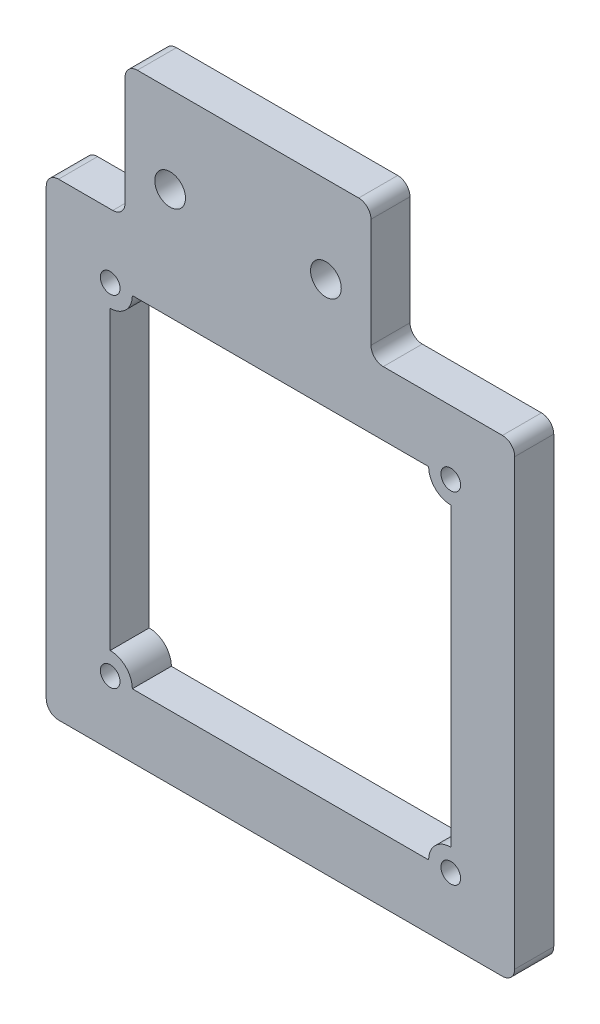
ISO-10303-21;
HEADER;
FILE_DESCRIPTION(('STEP AP214'),'2;1');
FILE_NAME('part.step','',(''),(''),'','','');
FILE_SCHEMA(('AUTOMOTIVE_DESIGN { 1 0 10303 214 1 1 1 1 }'));
ENDSEC;
DATA;
#1=APPLICATION_CONTEXT('core data for automotive mechanical design processes');
#2=APPLICATION_PROTOCOL_DEFINITION('international standard','automotive_design',2000,#1);
#3=PRODUCT_CONTEXT('',#1,'mechanical');
#4=PRODUCT('Part','Part','',(#3));
#5=PRODUCT_RELATED_PRODUCT_CATEGORY('part','',(#4));
#6=PRODUCT_DEFINITION_FORMATION('','',#4);
#7=PRODUCT_DEFINITION_CONTEXT('part definition',#1,'design');
#8=PRODUCT_DEFINITION('design','',#6,#7);
#9=PRODUCT_DEFINITION_SHAPE('','',#8);
#10=(LENGTH_UNIT() NAMED_UNIT(*) SI_UNIT(.MILLI.,.METRE.));
#11=(NAMED_UNIT(*) PLANE_ANGLE_UNIT() SI_UNIT($,.RADIAN.));
#12=(NAMED_UNIT(*) SI_UNIT($,.STERADIAN.) SOLID_ANGLE_UNIT());
#13=UNCERTAINTY_MEASURE_WITH_UNIT(LENGTH_MEASURE(1.E-05),#10,'distance_accuracy_value','');
#14=(GEOMETRIC_REPRESENTATION_CONTEXT(3) GLOBAL_UNCERTAINTY_ASSIGNED_CONTEXT((#13)) GLOBAL_UNIT_ASSIGNED_CONTEXT((#10,
#11,#12)) REPRESENTATION_CONTEXT('',''));
#15=CARTESIAN_POINT('',(0.,0.,0.));
#16=DIRECTION('',(0.,0.,1.));
#17=DIRECTION('',(1.,0.,0.));
#18=AXIS2_PLACEMENT_3D('',#15,#16,#17);
#19=CARTESIAN_POINT('',(0.,0.,3.175));
#20=DIRECTION('',(0.,0.,1.));
#21=DIRECTION('',(1.,0.,0.));
#22=AXIS2_PLACEMENT_3D('',#19,#20,#21);
#23=PLANE('',#22);
#24=CARTESIAN_POINT('',(-1.20910547078258,-5.19999999999999,3.175));
#25=DIRECTION('',(0.,0.,1.));
#26=DIRECTION('',(1.,0.,0.));
#27=AXIS2_PLACEMENT_3D('',#24,#25,#26);
#28=CIRCLE('',#27,0.8);
#29=CARTESIAN_POINT('',(-0.409105470782583,-5.19999999999999,3.175));
#30=VERTEX_POINT('',#29);
#31=EDGE_CURVE('E907',#30,#30,#28,.T.);
#32=ORIENTED_EDGE('',*,*,#31,.F.);
#33=EDGE_LOOP('',(#32));
#34=FACE_BOUND('',#33,.T.);
#35=CARTESIAN_POINT('',(3.66495523115076,3.81159322250824,3.175));
#36=DIRECTION('',(0.,0.,1.));
#37=DIRECTION('',(1.,0.,0.));
#38=AXIS2_PLACEMENT_3D('',#35,#36,#37);
#39=CIRCLE('',#38,1.25);
#40=CARTESIAN_POINT('',(4.91495523115076,3.81159322250824,3.175));
#41=VERTEX_POINT('',#40);
#42=EDGE_CURVE('E592',#41,#41,#39,.T.);
#43=ORIENTED_EDGE('',*,*,#42,.F.);
#44=EDGE_LOOP('',(#43));
#45=FACE_BOUND('',#44,.T.);
#46=CARTESIAN_POINT('',(-1.20910547078258,-32.9,3.175));
#47=DIRECTION('',(0.,0.,1.));
#48=DIRECTION('',(1.,0.,0.));
#49=AXIS2_PLACEMENT_3D('',#46,#47,#48);
#50=CIRCLE('',#49,0.800000000000001);
#51=CARTESIAN_POINT('',(-0.409105470782583,-32.9,3.175));
#52=VERTEX_POINT('',#51);
#53=EDGE_CURVE('E604',#52,#52,#50,.T.);
#54=ORIENTED_EDGE('',*,*,#53,.F.);
#55=EDGE_LOOP('',(#54));
#56=FACE_BOUND('',#55,.T.);
#57=DIRECTION('',(0.,-1.,0.));
#58=VECTOR('',#57,1.);
#59=CARTESIAN_POINT('',(20.,10.8755385296888,3.175));
#60=LINE('',#59,#58);
#61=CARTESIAN_POINT('',(20.,9.87553852968881,3.175));
#62=VERTEX_POINT('',#61);
#63=CARTESIAN_POINT('',(20.,1.,3.175));
#64=VERTEX_POINT('',#63);
#65=EDGE_CURVE('E630',#62,#64,#60,.T.);
#66=ORIENTED_EDGE('',*,*,#65,.F.);
#67=CARTESIAN_POINT('',(19.,9.87553852968881,3.175));
#68=DIRECTION('',(0.,0.,1.));
#69=DIRECTION('',(1.,0.,0.));
#70=AXIS2_PLACEMENT_3D('',#67,#68,#69);
#71=CIRCLE('',#70,1.);
#72=CARTESIAN_POINT('',(19.,10.8755385296888,3.175));
#73=VERTEX_POINT('',#72);
#74=EDGE_CURVE('E690',#62,#73,#71,.T.);
#75=ORIENTED_EDGE('',*,*,#74,.T.);
#76=DIRECTION('',(-1.,0.,0.));
#77=VECTOR('',#76,1.);
#78=CARTESIAN_POINT('',(20.,10.8755385296888,3.175));
#79=LINE('',#78,#77);
#80=CARTESIAN_POINT('',(1.,10.8755385296888,3.175));
#81=VERTEX_POINT('',#80);
#82=EDGE_CURVE('E610',#73,#81,#79,.T.);
#83=ORIENTED_EDGE('',*,*,#82,.T.);
#84=CARTESIAN_POINT('',(1.,9.87553852968881,3.175));
#85=DIRECTION('',(0.,0.,1.));
#86=DIRECTION('',(1.,0.,0.));
#87=AXIS2_PLACEMENT_3D('',#84,#85,#86);
#88=CIRCLE('',#87,1.);
#89=CARTESIAN_POINT('',(0.,9.87553852968881,3.175));
#90=VERTEX_POINT('',#89);
#91=EDGE_CURVE('E688',#81,#90,#88,.T.);
#92=ORIENTED_EDGE('',*,*,#91,.T.);
#93=DIRECTION('',(0.,-1.,0.));
#94=VECTOR('',#93,1.);
#95=CARTESIAN_POINT('',(0.,10.8755385296888,3.175));
#96=LINE('',#95,#94);
#97=CARTESIAN_POINT('',(0.,1.,3.175));
#98=VERTEX_POINT('',#97);
#99=EDGE_CURVE('E613',#90,#98,#96,.T.);
#100=ORIENTED_EDGE('',*,*,#99,.T.);
#101=CARTESIAN_POINT('',(-1.,1.,3.175));
#102=DIRECTION('',(0.,0.,1.));
#103=DIRECTION('',(1.,0.,0.));
#104=AXIS2_PLACEMENT_3D('',#101,#102,#103);
#105=CIRCLE('',#104,1.);
#106=CARTESIAN_POINT('',(-1.,0.,3.175));
#107=VERTEX_POINT('',#106);
#108=EDGE_CURVE('E12',#98,#107,#105,.F.);
#109=ORIENTED_EDGE('',*,*,#108,.T.);
#110=DIRECTION('',(-1.,0.,0.));
#111=VECTOR('',#110,1.);
#112=CARTESIAN_POINT('',(0.,0.,3.175));
#113=LINE('',#112,#111);
#114=CARTESIAN_POINT('',(-5.40910547078259,0.,3.175));
#115=VERTEX_POINT('',#114);
#116=EDGE_CURVE('E617',#107,#115,#113,.T.);
#117=ORIENTED_EDGE('',*,*,#116,.T.);
#118=CARTESIAN_POINT('',(-5.40910547078259,-0.999999999999994,3.175));
#119=DIRECTION('',(0.,0.,1.));
#120=DIRECTION('',(1.,0.,0.));
#121=AXIS2_PLACEMENT_3D('',#118,#119,#120);
#122=CIRCLE('',#121,1.);
#123=CARTESIAN_POINT('',(-6.40910547078259,-0.999999999999994,3.175));
#124=VERTEX_POINT('',#123);
#125=EDGE_CURVE('E686',#115,#124,#122,.T.);
#126=ORIENTED_EDGE('',*,*,#125,.T.);
#127=DIRECTION('',(0.,-1.,0.));
#128=VECTOR('',#127,1.);
#129=CARTESIAN_POINT('',(-6.40910547078259,0.,3.175));
#130=LINE('',#129,#128);
#131=CARTESIAN_POINT('',(-6.40910547078259,-37.1,3.175));
#132=VERTEX_POINT('',#131);
#133=EDGE_CURVE('E620',#124,#132,#130,.T.);
#134=ORIENTED_EDGE('',*,*,#133,.T.);
#135=CARTESIAN_POINT('',(-5.40910547078259,-37.1,3.175));
#136=DIRECTION('',(0.,0.,1.));
#137=DIRECTION('',(1.,0.,0.));
#138=AXIS2_PLACEMENT_3D('',#135,#136,#137);
#139=CIRCLE('',#138,1.);
#140=CARTESIAN_POINT('',(-5.40910547078259,-38.1,3.175));
#141=VERTEX_POINT('',#140);
#142=EDGE_CURVE('E684',#132,#141,#139,.T.);
#143=ORIENTED_EDGE('',*,*,#142,.T.);
#144=DIRECTION('',(1.,0.,0.));
#145=VECTOR('',#144,1.);
#146=CARTESIAN_POINT('',(-6.40910547078259,-38.1,3.175));
#147=LINE('',#146,#145);
#148=CARTESIAN_POINT('',(30.6908945292174,-38.1,3.175));
#149=VERTEX_POINT('',#148);
#150=EDGE_CURVE('E623',#141,#149,#147,.T.);
#151=ORIENTED_EDGE('',*,*,#150,.T.);
#152=CARTESIAN_POINT('',(30.6908945292174,-37.1,3.175));
#153=DIRECTION('',(0.,0.,1.));
#154=DIRECTION('',(1.,0.,0.));
#155=AXIS2_PLACEMENT_3D('',#152,#153,#154);
#156=CIRCLE('',#155,1.);
#157=CARTESIAN_POINT('',(31.6908945292174,-37.1,3.175));
#158=VERTEX_POINT('',#157);
#159=EDGE_CURVE('E374',#149,#158,#156,.T.);
#160=ORIENTED_EDGE('',*,*,#159,.T.);
#161=DIRECTION('',(0.,1.,0.));
#162=VECTOR('',#161,1.);
#163=CARTESIAN_POINT('',(31.6908945292174,-38.1,3.175));
#164=LINE('',#163,#162);
#165=CARTESIAN_POINT('',(31.6908945292174,-0.999999999999987,3.175));
#166=VERTEX_POINT('',#165);
#167=EDGE_CURVE('E625',#158,#166,#164,.T.);
#168=ORIENTED_EDGE('',*,*,#167,.T.);
#169=CARTESIAN_POINT('',(30.6908945292174,-0.99999999999999,3.175));
#170=DIRECTION('',(0.,0.,1.));
#171=DIRECTION('',(1.,0.,0.));
#172=AXIS2_PLACEMENT_3D('',#169,#170,#171);
#173=CIRCLE('',#172,1.);
#174=CARTESIAN_POINT('',(30.6908945292174,0.,3.175));
#175=VERTEX_POINT('',#174);
#176=EDGE_CURVE('E682',#166,#175,#173,.T.);
#177=ORIENTED_EDGE('',*,*,#176,.T.);
#178=DIRECTION('',(-1.,0.,0.));
#179=VECTOR('',#178,1.);
#180=CARTESIAN_POINT('',(31.6908945292174,0.,3.175));
#181=LINE('',#180,#179);
#182=CARTESIAN_POINT('',(21.,0.,3.175));
#183=VERTEX_POINT('',#182);
#184=EDGE_CURVE('E627',#175,#183,#181,.T.);
#185=ORIENTED_EDGE('',*,*,#184,.T.);
#186=CARTESIAN_POINT('',(21.,1.,3.175));
#187=DIRECTION('',(0.,0.,1.));
#188=DIRECTION('',(1.,0.,0.));
#189=AXIS2_PLACEMENT_3D('',#186,#187,#188);
#190=CIRCLE('',#189,1.);
#191=EDGE_CURVE('E718',#183,#64,#190,.F.);
#192=ORIENTED_EDGE('',*,*,#191,.T.);
#193=EDGE_LOOP('',(#66,#75,#83,#92,#100,#109,#117,#126,#134,#143,#151,#160,#168,#177,#185,#192));
#194=FACE_BOUND('',#193,.T.);
#195=CARTESIAN_POINT('',(26.4908945292174,-32.9,3.175));
#196=DIRECTION('',(0.,0.,1.));
#197=DIRECTION('',(1.,0.,0.));
#198=AXIS2_PLACEMENT_3D('',#195,#196,#197);
#199=CIRCLE('',#198,0.8);
#200=CARTESIAN_POINT('',(27.2908945292174,-32.9,3.175));
#201=VERTEX_POINT('',#200);
#202=EDGE_CURVE('E598',#201,#201,#199,.T.);
#203=ORIENTED_EDGE('',*,*,#202,.F.);
#204=EDGE_LOOP('',(#203));
#205=FACE_BOUND('',#204,.T.);
#206=CARTESIAN_POINT('',(-1.20910547078258,-5.19999999999999,3.175));
#207=DIRECTION('',(0.,0.,1.));
#208=DIRECTION('',(1.,0.,0.));
#209=AXIS2_PLACEMENT_3D('',#206,#207,#208);
#210=CIRCLE('',#209,1.8);
#211=CARTESIAN_POINT('',(-1.20910547078258,-6.99999999999999,3.175));
#212=VERTEX_POINT('',#211);
#213=CARTESIAN_POINT('',(0.590894529217419,-5.19999999999999,3.175));
#214=VERTEX_POINT('',#213);
#215=EDGE_CURVE('E526',#212,#214,#210,.T.);
#216=ORIENTED_EDGE('',*,*,#215,.T.);
#217=DIRECTION('',(-1.,0.,0.));
#218=VECTOR('',#217,1.);
#219=CARTESIAN_POINT('',(24.6908945292174,-5.19999999999998,3.175));
#220=LINE('',#219,#218);
#221=CARTESIAN_POINT('',(24.6908945292174,-5.19999999999998,3.175));
#222=VERTEX_POINT('',#221);
#223=EDGE_CURVE('E514',#222,#214,#220,.T.);
#224=ORIENTED_EDGE('',*,*,#223,.F.);
#225=CARTESIAN_POINT('',(26.4908945292174,-5.19999999999999,3.175));
#226=DIRECTION('',(0.,0.,-1.));
#227=DIRECTION('',(-1.,0.,0.));
#228=AXIS2_PLACEMENT_3D('',#225,#226,#227);
#229=CIRCLE('',#228,1.8);
#230=CARTESIAN_POINT('',(26.4908945292174,-6.99999999999999,3.175));
#231=VERTEX_POINT('',#230);
#232=EDGE_CURVE('E525',#231,#222,#229,.T.);
#233=ORIENTED_EDGE('',*,*,#232,.F.);
#234=DIRECTION('',(0.,-1.,0.));
#235=VECTOR('',#234,1.);
#236=CARTESIAN_POINT('',(26.4908945292174,-6.99999999999999,3.175));
#237=LINE('',#236,#235);
#238=CARTESIAN_POINT('',(26.4908945292174,-31.1,3.175));
#239=VERTEX_POINT('',#238);
#240=EDGE_CURVE('E548',#231,#239,#237,.T.);
#241=ORIENTED_EDGE('',*,*,#240,.T.);
#242=CARTESIAN_POINT('',(26.4908945292174,-32.9,3.175));
#243=DIRECTION('',(0.,0.,1.));
#244=DIRECTION('',(1.,0.,0.));
#245=AXIS2_PLACEMENT_3D('',#242,#243,#244);
#246=CIRCLE('',#245,1.8);
#247=CARTESIAN_POINT('',(24.6908945292174,-32.9,3.175));
#248=VERTEX_POINT('',#247);
#249=EDGE_CURVE('E551',#239,#248,#246,.T.);
#250=ORIENTED_EDGE('',*,*,#249,.T.);
#251=DIRECTION('',(-1.,0.,0.));
#252=VECTOR('',#251,1.);
#253=CARTESIAN_POINT('',(24.6908945292174,-32.9,3.175));
#254=LINE('',#253,#252);
#255=CARTESIAN_POINT('',(0.590894529217417,-32.9,3.175));
#256=VERTEX_POINT('',#255);
#257=EDGE_CURVE('E554',#248,#256,#254,.T.);
#258=ORIENTED_EDGE('',*,*,#257,.T.);
#259=CARTESIAN_POINT('',(-1.20910547078258,-32.9,3.175));
#260=DIRECTION('',(0.,0.,1.));
#261=DIRECTION('',(1.,0.,0.));
#262=AXIS2_PLACEMENT_3D('',#259,#260,#261);
#263=CIRCLE('',#262,1.8);
#264=CARTESIAN_POINT('',(-1.20910547078258,-31.1,3.175));
#265=VERTEX_POINT('',#264);
#266=EDGE_CURVE('E557',#256,#265,#263,.T.);
#267=ORIENTED_EDGE('',*,*,#266,.T.);
#268=DIRECTION('',(0.,-1.,0.));
#269=VECTOR('',#268,1.);
#270=CARTESIAN_POINT('',(-1.20910547078258,-6.99999999999999,3.175));
#271=LINE('',#270,#269);
#272=EDGE_CURVE('E534',#212,#265,#271,.T.);
#273=ORIENTED_EDGE('',*,*,#272,.F.);
#274=EDGE_LOOP('',(#216,#224,#233,#241,#250,#258,#267,#273));
#275=FACE_BOUND('',#274,.T.);
#276=CARTESIAN_POINT('',(26.4908945292174,-5.19999999999999,3.175));
#277=DIRECTION('',(0.,0.,1.));
#278=DIRECTION('',(1.,0.,0.));
#279=AXIS2_PLACEMENT_3D('',#276,#277,#278);
#280=CIRCLE('',#279,0.799999999999999);
#281=CARTESIAN_POINT('',(27.2908945292174,-5.19999999999999,3.175));
#282=VERTEX_POINT('',#281);
#283=EDGE_CURVE('E562',#282,#282,#280,.T.);
#284=ORIENTED_EDGE('',*,*,#283,.F.);
#285=EDGE_LOOP('',(#284));
#286=FACE_BOUND('',#285,.T.);
#287=CARTESIAN_POINT('',(16.3350447688493,3.81159322250824,3.175));
#288=DIRECTION('',(0.,0.,1.));
#289=DIRECTION('',(1.,0.,0.));
#290=AXIS2_PLACEMENT_3D('',#287,#288,#289);
#291=CIRCLE('',#290,1.25);
#292=CARTESIAN_POINT('',(17.5850447688493,3.81159322250824,3.175));
#293=VERTEX_POINT('',#292);
#294=EDGE_CURVE('E903',#293,#293,#291,.T.);
#295=ORIENTED_EDGE('',*,*,#294,.F.);
#296=EDGE_LOOP('',(#295));
#297=FACE_BOUND('',#296,.T.);
#298=ADVANCED_FACE('F352',(#34,#45,#56,#194,#205,#275,#286,#297),#23,.T.);
#299=CARTESIAN_POINT('',(0.,0.,0.));
#300=DIRECTION('',(0.,0.,1.));
#301=DIRECTION('',(1.,0.,0.));
#302=AXIS2_PLACEMENT_3D('',#299,#300,#301);
#303=PLANE('',#302);
#304=DIRECTION('',(-1.,0.,0.));
#305=VECTOR('',#304,1.);
#306=CARTESIAN_POINT('',(24.6908945292174,-5.19999999999998,0.));
#307=LINE('',#306,#305);
#308=CARTESIAN_POINT('',(24.6908945292174,-5.19999999999999,0.));
#309=VERTEX_POINT('',#308);
#310=CARTESIAN_POINT('',(0.590894529217419,-5.19999999999999,0.));
#311=VERTEX_POINT('',#310);
#312=EDGE_CURVE('E561',#309,#311,#307,.T.);
#313=ORIENTED_EDGE('',*,*,#312,.T.);
#314=CARTESIAN_POINT('',(-1.20910547078258,-5.19999999999999,0.));
#315=DIRECTION('',(0.,0.,1.));
#316=DIRECTION('',(1.,0.,0.));
#317=AXIS2_PLACEMENT_3D('',#314,#315,#316);
#318=CIRCLE('',#317,1.8);
#319=CARTESIAN_POINT('',(-1.20910547078258,-6.99999999999999,0.));
#320=VERTEX_POINT('',#319);
#321=EDGE_CURVE('E533',#320,#311,#318,.T.);
#322=ORIENTED_EDGE('',*,*,#321,.F.);
#323=DIRECTION('',(0.,-1.,0.));
#324=VECTOR('',#323,1.);
#325=CARTESIAN_POINT('',(-1.20910547078258,-6.99999999999999,0.));
#326=LINE('',#325,#324);
#327=CARTESIAN_POINT('',(-1.20910547078258,-31.1,0.));
#328=VERTEX_POINT('',#327);
#329=EDGE_CURVE('E538',#320,#328,#326,.T.);
#330=ORIENTED_EDGE('',*,*,#329,.T.);
#331=CARTESIAN_POINT('',(-1.20910547078258,-32.9,0.));
#332=DIRECTION('',(0.,0.,1.));
#333=DIRECTION('',(1.,0.,0.));
#334=AXIS2_PLACEMENT_3D('',#331,#332,#333);
#335=CIRCLE('',#334,1.8);
#336=CARTESIAN_POINT('',(0.590894529217417,-32.9,0.));
#337=VERTEX_POINT('',#336);
#338=EDGE_CURVE('E541',#337,#328,#335,.T.);
#339=ORIENTED_EDGE('',*,*,#338,.F.);
#340=DIRECTION('',(-1.,0.,0.));
#341=VECTOR('',#340,1.);
#342=CARTESIAN_POINT('',(24.6908945292174,-32.9,0.));
#343=LINE('',#342,#341);
#344=CARTESIAN_POINT('',(24.6908945292174,-32.9,0.));
#345=VERTEX_POINT('',#344);
#346=EDGE_CURVE('E573',#345,#337,#343,.T.);
#347=ORIENTED_EDGE('',*,*,#346,.F.);
#348=CARTESIAN_POINT('',(26.4908945292174,-32.9,0.));
#349=DIRECTION('',(0.,0.,1.));
#350=DIRECTION('',(1.,0.,0.));
#351=AXIS2_PLACEMENT_3D('',#348,#349,#350);
#352=CIRCLE('',#351,1.8);
#353=CARTESIAN_POINT('',(26.4908945292174,-31.1,0.));
#354=VERTEX_POINT('',#353);
#355=EDGE_CURVE('E570',#354,#345,#352,.T.);
#356=ORIENTED_EDGE('',*,*,#355,.F.);
#357=DIRECTION('',(0.,-1.,0.));
#358=VECTOR('',#357,1.);
#359=CARTESIAN_POINT('',(26.4908945292174,-6.99999999999999,0.));
#360=LINE('',#359,#358);
#361=CARTESIAN_POINT('',(26.4908945292174,-6.99999999999999,0.));
#362=VERTEX_POINT('',#361);
#363=EDGE_CURVE('E567',#362,#354,#360,.T.);
#364=ORIENTED_EDGE('',*,*,#363,.F.);
#365=CARTESIAN_POINT('',(26.4908945292174,-5.19999999999999,0.));
#366=DIRECTION('',(0.,0.,-1.));
#367=DIRECTION('',(-1.,0.,0.));
#368=AXIS2_PLACEMENT_3D('',#365,#366,#367);
#369=CIRCLE('',#368,1.8);
#370=EDGE_CURVE('E564',#362,#309,#369,.T.);
#371=ORIENTED_EDGE('',*,*,#370,.T.);
#372=EDGE_LOOP('',(#313,#322,#330,#339,#347,#356,#364,#371));
#373=FACE_BOUND('',#372,.T.);
#374=DIRECTION('',(-1.,0.,0.));
#375=VECTOR('',#374,1.);
#376=CARTESIAN_POINT('',(20.,10.8755385296888,0.));
#377=LINE('',#376,#375);
#378=CARTESIAN_POINT('',(19.,10.8755385296888,0.));
#379=VERTEX_POINT('',#378);
#380=CARTESIAN_POINT('',(1.,10.8755385296888,0.));
#381=VERTEX_POINT('',#380);
#382=EDGE_CURVE('E607',#379,#381,#377,.T.);
#383=ORIENTED_EDGE('',*,*,#382,.F.);
#384=CARTESIAN_POINT('',(19.,9.87553852968881,0.));
#385=DIRECTION('',(0.,0.,1.));
#386=DIRECTION('',(1.,0.,0.));
#387=AXIS2_PLACEMENT_3D('',#384,#385,#386);
#388=CIRCLE('',#387,1.);
#389=CARTESIAN_POINT('',(20.,9.87553852968881,0.));
#390=VERTEX_POINT('',#389);
#391=EDGE_CURVE('E679',#379,#390,#388,.F.);
#392=ORIENTED_EDGE('',*,*,#391,.T.);
#393=DIRECTION('',(0.,-1.,0.));
#394=VECTOR('',#393,1.);
#395=CARTESIAN_POINT('',(20.,10.8755385296888,0.));
#396=LINE('',#395,#394);
#397=CARTESIAN_POINT('',(20.,1.,0.));
#398=VERTEX_POINT('',#397);
#399=EDGE_CURVE('E614',#390,#398,#396,.T.);
#400=ORIENTED_EDGE('',*,*,#399,.T.);
#401=CARTESIAN_POINT('',(21.,1.,0.));
#402=DIRECTION('',(0.,0.,1.));
#403=DIRECTION('',(1.,0.,0.));
#404=AXIS2_PLACEMENT_3D('',#401,#402,#403);
#405=CIRCLE('',#404,1.);
#406=CARTESIAN_POINT('',(21.,0.,0.));
#407=VERTEX_POINT('',#406);
#408=EDGE_CURVE('E716',#398,#407,#405,.T.);
#409=ORIENTED_EDGE('',*,*,#408,.T.);
#410=DIRECTION('',(-1.,0.,0.));
#411=VECTOR('',#410,1.);
#412=CARTESIAN_POINT('',(31.6908945292174,0.,0.));
#413=LINE('',#412,#411);
#414=CARTESIAN_POINT('',(30.6908945292174,0.,0.));
#415=VERTEX_POINT('',#414);
#416=EDGE_CURVE('E650',#415,#407,#413,.T.);
#417=ORIENTED_EDGE('',*,*,#416,.F.);
#418=CARTESIAN_POINT('',(30.6908945292174,-0.99999999999999,0.));
#419=DIRECTION('',(0.,0.,1.));
#420=DIRECTION('',(1.,0.,0.));
#421=AXIS2_PLACEMENT_3D('',#418,#419,#420);
#422=CIRCLE('',#421,1.);
#423=CARTESIAN_POINT('',(31.6908945292174,-0.999999999999987,0.));
#424=VERTEX_POINT('',#423);
#425=EDGE_CURVE('E671',#415,#424,#422,.F.);
#426=ORIENTED_EDGE('',*,*,#425,.T.);
#427=DIRECTION('',(0.,1.,0.));
#428=VECTOR('',#427,1.);
#429=CARTESIAN_POINT('',(31.6908945292174,-38.1,0.));
#430=LINE('',#429,#428);
#431=CARTESIAN_POINT('',(31.6908945292174,-37.1,0.));
#432=VERTEX_POINT('',#431);
#433=EDGE_CURVE('E648',#432,#424,#430,.T.);
#434=ORIENTED_EDGE('',*,*,#433,.F.);
#435=CARTESIAN_POINT('',(30.6908945292174,-37.1,0.));
#436=DIRECTION('',(0.,0.,1.));
#437=DIRECTION('',(1.,0.,0.));
#438=AXIS2_PLACEMENT_3D('',#435,#436,#437);
#439=CIRCLE('',#438,1.);
#440=CARTESIAN_POINT('',(30.6908945292174,-38.1,0.));
#441=VERTEX_POINT('',#440);
#442=EDGE_CURVE('E669',#432,#441,#439,.F.);
#443=ORIENTED_EDGE('',*,*,#442,.T.);
#444=DIRECTION('',(1.,0.,0.));
#445=VECTOR('',#444,1.);
#446=CARTESIAN_POINT('',(-6.40910547078259,-38.1,0.));
#447=LINE('',#446,#445);
#448=CARTESIAN_POINT('',(-5.40910547078259,-38.1,0.));
#449=VERTEX_POINT('',#448);
#450=EDGE_CURVE('E645',#449,#441,#447,.T.);
#451=ORIENTED_EDGE('',*,*,#450,.F.);
#452=CARTESIAN_POINT('',(-5.40910547078259,-37.1,0.));
#453=DIRECTION('',(0.,0.,1.));
#454=DIRECTION('',(1.,0.,0.));
#455=AXIS2_PLACEMENT_3D('',#452,#453,#454);
#456=CIRCLE('',#455,1.);
#457=CARTESIAN_POINT('',(-6.40910547078259,-37.1,0.));
#458=VERTEX_POINT('',#457);
#459=EDGE_CURVE('E673',#449,#458,#456,.F.);
#460=ORIENTED_EDGE('',*,*,#459,.T.);
#461=DIRECTION('',(0.,-1.,0.));
#462=VECTOR('',#461,1.);
#463=CARTESIAN_POINT('',(-6.40910547078259,0.,0.));
#464=LINE('',#463,#462);
#465=CARTESIAN_POINT('',(-6.40910547078259,-0.999999999999994,0.));
#466=VERTEX_POINT('',#465);
#467=EDGE_CURVE('E642',#466,#458,#464,.T.);
#468=ORIENTED_EDGE('',*,*,#467,.F.);
#469=CARTESIAN_POINT('',(-5.40910547078259,-0.999999999999994,0.));
#470=DIRECTION('',(0.,0.,1.));
#471=DIRECTION('',(1.,0.,0.));
#472=AXIS2_PLACEMENT_3D('',#469,#470,#471);
#473=CIRCLE('',#472,1.);
#474=CARTESIAN_POINT('',(-5.40910547078259,0.,0.));
#475=VERTEX_POINT('',#474);
#476=EDGE_CURVE('E675',#466,#475,#473,.F.);
#477=ORIENTED_EDGE('',*,*,#476,.T.);
#478=DIRECTION('',(-1.,0.,0.));
#479=VECTOR('',#478,1.);
#480=CARTESIAN_POINT('',(0.,0.,0.));
#481=LINE('',#480,#479);
#482=CARTESIAN_POINT('',(-1.,0.,0.));
#483=VERTEX_POINT('',#482);
#484=EDGE_CURVE('E639',#483,#475,#481,.T.);
#485=ORIENTED_EDGE('',*,*,#484,.F.);
#486=CARTESIAN_POINT('',(-1.,1.,0.));
#487=DIRECTION('',(0.,0.,1.));
#488=DIRECTION('',(1.,0.,0.));
#489=AXIS2_PLACEMENT_3D('',#486,#487,#488);
#490=CIRCLE('',#489,1.);
#491=CARTESIAN_POINT('',(0.,1.,0.));
#492=VERTEX_POINT('',#491);
#493=EDGE_CURVE('E360',#483,#492,#490,.T.);
#494=ORIENTED_EDGE('',*,*,#493,.T.);
#495=DIRECTION('',(0.,-1.,0.));
#496=VECTOR('',#495,1.);
#497=CARTESIAN_POINT('',(0.,10.8755385296888,0.));
#498=LINE('',#497,#496);
#499=CARTESIAN_POINT('',(0.,9.87553852968881,0.));
#500=VERTEX_POINT('',#499);
#501=EDGE_CURVE('E636',#500,#492,#498,.T.);
#502=ORIENTED_EDGE('',*,*,#501,.F.);
#503=CARTESIAN_POINT('',(1.,9.87553852968881,0.));
#504=DIRECTION('',(0.,0.,1.));
#505=DIRECTION('',(1.,0.,0.));
#506=AXIS2_PLACEMENT_3D('',#503,#504,#505);
#507=CIRCLE('',#506,1.);
#508=EDGE_CURVE('E677',#500,#381,#507,.F.);
#509=ORIENTED_EDGE('',*,*,#508,.T.);
#510=EDGE_LOOP('',(#383,#392,#400,#409,#417,#426,#434,#443,#451,#460,#468,#477,#485,#494,#502,#509));
#511=FACE_BOUND('',#510,.T.);
#512=CARTESIAN_POINT('',(-1.20910547078258,-32.9,0.));
#513=DIRECTION('',(0.,0.,1.));
#514=DIRECTION('',(1.,0.,0.));
#515=AXIS2_PLACEMENT_3D('',#512,#513,#514);
#516=CIRCLE('',#515,0.800000000000001);
#517=CARTESIAN_POINT('',(-0.409105470782583,-32.9,0.));
#518=VERTEX_POINT('',#517);
#519=EDGE_CURVE('E601',#518,#518,#516,.T.);
#520=ORIENTED_EDGE('',*,*,#519,.T.);
#521=EDGE_LOOP('',(#520));
#522=FACE_BOUND('',#521,.T.);
#523=CARTESIAN_POINT('',(26.4908945292174,-32.9,0.));
#524=DIRECTION('',(0.,0.,1.));
#525=DIRECTION('',(1.,0.,0.));
#526=AXIS2_PLACEMENT_3D('',#523,#524,#525);
#527=CIRCLE('',#526,0.8);
#528=CARTESIAN_POINT('',(27.2908945292174,-32.9,0.));
#529=VERTEX_POINT('',#528);
#530=EDGE_CURVE('E595',#529,#529,#527,.T.);
#531=ORIENTED_EDGE('',*,*,#530,.T.);
#532=EDGE_LOOP('',(#531));
#533=FACE_BOUND('',#532,.T.);
#534=CARTESIAN_POINT('',(3.66495523115076,3.81159322250824,0.));
#535=DIRECTION('',(0.,0.,1.));
#536=DIRECTION('',(1.,0.,0.));
#537=AXIS2_PLACEMENT_3D('',#534,#535,#536);
#538=CIRCLE('',#537,1.25);
#539=CARTESIAN_POINT('',(4.91495523115076,3.81159322250824,0.));
#540=VERTEX_POINT('',#539);
#541=EDGE_CURVE('E580',#540,#540,#538,.T.);
#542=ORIENTED_EDGE('',*,*,#541,.T.);
#543=EDGE_LOOP('',(#542));
#544=FACE_BOUND('',#543,.T.);
#545=CARTESIAN_POINT('',(26.4908945292174,-5.19999999999999,0.));
#546=DIRECTION('',(0.,0.,1.));
#547=DIRECTION('',(1.,0.,0.));
#548=AXIS2_PLACEMENT_3D('',#545,#546,#547);
#549=CIRCLE('',#548,0.799999999999999);
#550=CARTESIAN_POINT('',(27.2908945292174,-5.19999999999999,0.));
#551=VERTEX_POINT('',#550);
#552=EDGE_CURVE('E544',#551,#551,#549,.T.);
#553=ORIENTED_EDGE('',*,*,#552,.T.);
#554=EDGE_LOOP('',(#553));
#555=FACE_BOUND('',#554,.T.);
#556=CARTESIAN_POINT('',(-1.20910547078258,-5.19999999999999,0.));
#557=DIRECTION('',(0.,0.,1.));
#558=DIRECTION('',(1.,0.,0.));
#559=AXIS2_PLACEMENT_3D('',#556,#557,#558);
#560=CIRCLE('',#559,0.8);
#561=CARTESIAN_POINT('',(-0.409105470782583,-5.19999999999999,0.));
#562=VERTEX_POINT('',#561);
#563=EDGE_CURVE('E899',#562,#562,#560,.T.);
#564=ORIENTED_EDGE('',*,*,#563,.T.);
#565=EDGE_LOOP('',(#564));
#566=FACE_BOUND('',#565,.T.);
#567=CARTESIAN_POINT('',(16.3350447688493,3.81159322250824,0.));
#568=DIRECTION('',(0.,0.,1.));
#569=DIRECTION('',(1.,0.,0.));
#570=AXIS2_PLACEMENT_3D('',#567,#568,#569);
#571=CIRCLE('',#570,1.25);
#572=CARTESIAN_POINT('',(17.5850447688493,3.81159322250824,0.));
#573=VERTEX_POINT('',#572);
#574=EDGE_CURVE('E902',#573,#573,#571,.T.);
#575=ORIENTED_EDGE('',*,*,#574,.T.);
#576=EDGE_LOOP('',(#575));
#577=FACE_BOUND('',#576,.T.);
#578=ADVANCED_FACE('F723',(#373,#511,#522,#533,#544,#555,#566,#577),#303,.F.);
#579=CARTESIAN_POINT('',(20.,10.8755385296888,3.175));
#580=DIRECTION('',(0.,-1.,0.));
#581=DIRECTION('',(0.,0.,-1.));
#582=AXIS2_PLACEMENT_3D('',#579,#580,#581);
#583=PLANE('',#582);
#584=ORIENTED_EDGE('',*,*,#82,.F.);
#585=DIRECTION('',(0.,0.,-1.));
#586=VECTOR('',#585,1.);
#587=CARTESIAN_POINT('',(19.,10.8755385296888,0.));
#588=LINE('',#587,#586);
#589=EDGE_CURVE('E666',#73,#379,#588,.T.);
#590=ORIENTED_EDGE('',*,*,#589,.T.);
#591=ORIENTED_EDGE('',*,*,#382,.T.);
#592=DIRECTION('',(0.,0.,-1.));
#593=VECTOR('',#592,1.);
#594=CARTESIAN_POINT('',(1.,10.8755385296888,3.175));
#595=LINE('',#594,#593);
#596=EDGE_CURVE('E664',#381,#81,#595,.F.);
#597=ORIENTED_EDGE('',*,*,#596,.T.);
#598=EDGE_LOOP('',(#584,#590,#591,#597));
#599=FACE_BOUND('',#598,.T.);
#600=ADVANCED_FACE('F785',(#599),#583,.F.);
#601=CARTESIAN_POINT('',(0.,10.8755385296888,3.175));
#602=DIRECTION('',(1.,0.,0.));
#603=DIRECTION('',(0.,1.,0.));
#604=AXIS2_PLACEMENT_3D('',#601,#602,#603);
#605=PLANE('',#604);
#606=ORIENTED_EDGE('',*,*,#99,.F.);
#607=DIRECTION('',(0.,0.,-1.));
#608=VECTOR('',#607,1.);
#609=CARTESIAN_POINT('',(0.,9.87553852968881,3.175));
#610=LINE('',#609,#608);
#611=EDGE_CURVE('E694',#90,#500,#610,.T.);
#612=ORIENTED_EDGE('',*,*,#611,.T.);
#613=ORIENTED_EDGE('',*,*,#501,.T.);
#614=DIRECTION('',(0.,0.,-1.));
#615=VECTOR('',#614,1.);
#616=CARTESIAN_POINT('',(0.,1.,3.175));
#617=LINE('',#616,#615);
#618=EDGE_CURVE('E692',#492,#98,#617,.F.);
#619=ORIENTED_EDGE('',*,*,#618,.T.);
#620=EDGE_LOOP('',(#606,#612,#613,#619));
#621=FACE_BOUND('',#620,.T.);
#622=ADVANCED_FACE('F730',(#621),#605,.F.);
#623=CARTESIAN_POINT('',(0.,0.,3.175));
#624=DIRECTION('',(0.,-1.,0.));
#625=DIRECTION('',(1.,0.,0.));
#626=AXIS2_PLACEMENT_3D('',#623,#624,#625);
#627=PLANE('',#626);
#628=ORIENTED_EDGE('',*,*,#116,.F.);
#629=DIRECTION('',(0.,0.,-1.));
#630=VECTOR('',#629,1.);
#631=CARTESIAN_POINT('',(-1.,0.,0.));
#632=LINE('',#631,#630);
#633=EDGE_CURVE('E699',#107,#483,#632,.T.);
#634=ORIENTED_EDGE('',*,*,#633,.T.);
#635=ORIENTED_EDGE('',*,*,#484,.T.);
#636=DIRECTION('',(0.,0.,-1.));
#637=VECTOR('',#636,1.);
#638=CARTESIAN_POINT('',(-5.40910547078259,0.,3.175));
#639=LINE('',#638,#637);
#640=EDGE_CURVE('E697',#475,#115,#639,.F.);
#641=ORIENTED_EDGE('',*,*,#640,.T.);
#642=EDGE_LOOP('',(#628,#634,#635,#641));
#643=FACE_BOUND('',#642,.T.);
#644=ADVANCED_FACE('F739',(#643),#627,.F.);
#645=CARTESIAN_POINT('',(-6.40910547078259,0.,3.175));
#646=DIRECTION('',(1.,0.,0.));
#647=DIRECTION('',(0.,0.,-1.));
#648=AXIS2_PLACEMENT_3D('',#645,#646,#647);
#649=PLANE('',#648);
#650=ORIENTED_EDGE('',*,*,#133,.F.);
#651=DIRECTION('',(0.,0.,-1.));
#652=VECTOR('',#651,1.);
#653=CARTESIAN_POINT('',(-6.40910547078259,-0.999999999999994,3.175));
#654=LINE('',#653,#652);
#655=EDGE_CURVE('E704',#124,#466,#654,.T.);
#656=ORIENTED_EDGE('',*,*,#655,.T.);
#657=ORIENTED_EDGE('',*,*,#467,.T.);
#658=DIRECTION('',(0.,0.,-1.));
#659=VECTOR('',#658,1.);
#660=CARTESIAN_POINT('',(-6.40910547078259,-37.1,3.175));
#661=LINE('',#660,#659);
#662=EDGE_CURVE('E702',#458,#132,#661,.F.);
#663=ORIENTED_EDGE('',*,*,#662,.T.);
#664=EDGE_LOOP('',(#650,#656,#657,#663));
#665=FACE_BOUND('',#664,.T.);
#666=ADVANCED_FACE('F747',(#665),#649,.F.);
#667=CARTESIAN_POINT('',(-6.40910547078259,-38.1,3.175));
#668=DIRECTION('',(0.,1.,0.));
#669=DIRECTION('',(0.,0.,1.));
#670=AXIS2_PLACEMENT_3D('',#667,#668,#669);
#671=PLANE('',#670);
#672=ORIENTED_EDGE('',*,*,#150,.F.);
#673=DIRECTION('',(0.,0.,-1.));
#674=VECTOR('',#673,1.);
#675=CARTESIAN_POINT('',(-5.40910547078259,-38.1,3.175));
#676=LINE('',#675,#674);
#677=EDGE_CURVE('E709',#141,#449,#676,.T.);
#678=ORIENTED_EDGE('',*,*,#677,.T.);
#679=ORIENTED_EDGE('',*,*,#450,.T.);
#680=DIRECTION('',(0.,0.,-1.));
#681=VECTOR('',#680,1.);
#682=CARTESIAN_POINT('',(30.6908945292174,-38.1,3.175));
#683=LINE('',#682,#681);
#684=EDGE_CURVE('E707',#441,#149,#683,.F.);
#685=ORIENTED_EDGE('',*,*,#684,.T.);
#686=EDGE_LOOP('',(#672,#678,#679,#685));
#687=FACE_BOUND('',#686,.T.);
#688=ADVANCED_FACE('F755',(#687),#671,.F.);
#689=CARTESIAN_POINT('',(31.6908945292174,-38.1,3.175));
#690=DIRECTION('',(-1.,0.,0.));
#691=DIRECTION('',(0.,0.,1.));
#692=AXIS2_PLACEMENT_3D('',#689,#690,#691);
#693=PLANE('',#692);
#694=ORIENTED_EDGE('',*,*,#433,.T.);
#695=DIRECTION('',(0.,0.,-1.));
#696=VECTOR('',#695,1.);
#697=CARTESIAN_POINT('',(31.6908945292174,-0.999999999999987,3.175));
#698=LINE('',#697,#696);
#699=EDGE_CURVE('E367',#424,#166,#698,.F.);
#700=ORIENTED_EDGE('',*,*,#699,.T.);
#701=ORIENTED_EDGE('',*,*,#167,.F.);
#702=DIRECTION('',(0.,0.,-1.));
#703=VECTOR('',#702,1.);
#704=CARTESIAN_POINT('',(31.6908945292174,-37.1,3.175));
#705=LINE('',#704,#703);
#706=EDGE_CURVE('E712',#158,#432,#705,.T.);
#707=ORIENTED_EDGE('',*,*,#706,.T.);
#708=EDGE_LOOP('',(#694,#700,#701,#707));
#709=FACE_BOUND('',#708,.T.);
#710=ADVANCED_FACE('F761',(#709),#693,.F.);
#711=CARTESIAN_POINT('',(31.6908945292174,0.,3.175));
#712=DIRECTION('',(0.,-1.,0.));
#713=DIRECTION('',(1.,0.,0.));
#714=AXIS2_PLACEMENT_3D('',#711,#712,#713);
#715=PLANE('',#714);
#716=ORIENTED_EDGE('',*,*,#416,.T.);
#717=DIRECTION('',(0.,0.,-1.));
#718=VECTOR('',#717,1.);
#719=CARTESIAN_POINT('',(21.,0.,3.175));
#720=LINE('',#719,#718);
#721=EDGE_CURVE('E662',#407,#183,#720,.F.);
#722=ORIENTED_EDGE('',*,*,#721,.T.);
#723=ORIENTED_EDGE('',*,*,#184,.F.);
#724=DIRECTION('',(0.,0.,-1.));
#725=VECTOR('',#724,1.);
#726=CARTESIAN_POINT('',(30.6908945292174,0.,3.175));
#727=LINE('',#726,#725);
#728=EDGE_CURVE('E659',#175,#415,#727,.T.);
#729=ORIENTED_EDGE('',*,*,#728,.T.);
#730=EDGE_LOOP('',(#716,#722,#723,#729));
#731=FACE_BOUND('',#730,.T.);
#732=ADVANCED_FACE('F769',(#731),#715,.F.);
#733=CARTESIAN_POINT('',(20.,10.8755385296888,3.175));
#734=DIRECTION('',(1.,0.,0.));
#735=DIRECTION('',(0.,0.,-1.));
#736=AXIS2_PLACEMENT_3D('',#733,#734,#735);
#737=PLANE('',#736);
#738=ORIENTED_EDGE('',*,*,#65,.T.);
#739=DIRECTION('',(0.,0.,-1.));
#740=VECTOR('',#739,1.);
#741=CARTESIAN_POINT('',(20.,1.,3.175));
#742=LINE('',#741,#740);
#743=EDGE_CURVE('E656',#64,#398,#742,.T.);
#744=ORIENTED_EDGE('',*,*,#743,.T.);
#745=ORIENTED_EDGE('',*,*,#399,.F.);
#746=DIRECTION('',(0.,0.,-1.));
#747=VECTOR('',#746,1.);
#748=CARTESIAN_POINT('',(20.,9.87553852968881,3.175));
#749=LINE('',#748,#747);
#750=EDGE_CURVE('E633',#390,#62,#749,.F.);
#751=ORIENTED_EDGE('',*,*,#750,.T.);
#752=EDGE_LOOP('',(#738,#744,#745,#751));
#753=FACE_BOUND('',#752,.T.);
#754=ADVANCED_FACE('F777',(#753),#737,.T.);
#755=CARTESIAN_POINT('',(-1.20910547078258,-32.9,3.175));
#756=DIRECTION('',(0.,0.,-1.));
#757=DIRECTION('',(-1.,0.,0.));
#758=AXIS2_PLACEMENT_3D('',#755,#756,#757);
#759=CYLINDRICAL_SURFACE('',#758,0.800000000000001);
#760=ORIENTED_EDGE('',*,*,#53,.T.);
#761=EDGE_LOOP('',(#760));
#762=FACE_BOUND('',#761,.T.);
#763=ORIENTED_EDGE('',*,*,#519,.F.);
#764=EDGE_LOOP('',(#763));
#765=FACE_BOUND('',#764,.T.);
#766=ADVANCED_FACE('F809',(#762,#765),#759,.F.);
#767=CARTESIAN_POINT('',(26.4908945292174,-32.9,3.175));
#768=DIRECTION('',(0.,0.,-1.));
#769=DIRECTION('',(-1.,0.,0.));
#770=AXIS2_PLACEMENT_3D('',#767,#768,#769);
#771=CYLINDRICAL_SURFACE('',#770,0.8);
#772=ORIENTED_EDGE('',*,*,#202,.T.);
#773=EDGE_LOOP('',(#772));
#774=FACE_BOUND('',#773,.T.);
#775=ORIENTED_EDGE('',*,*,#530,.F.);
#776=EDGE_LOOP('',(#775));
#777=FACE_BOUND('',#776,.T.);
#778=ADVANCED_FACE('F878',(#774,#777),#771,.F.);
#779=CARTESIAN_POINT('',(3.66495523115076,3.81159322250824,3.175));
#780=DIRECTION('',(0.,0.,-1.));
#781=DIRECTION('',(-1.,0.,0.));
#782=AXIS2_PLACEMENT_3D('',#779,#780,#781);
#783=CYLINDRICAL_SURFACE('',#782,1.25);
#784=ORIENTED_EDGE('',*,*,#42,.T.);
#785=EDGE_LOOP('',(#784));
#786=FACE_BOUND('',#785,.T.);
#787=ORIENTED_EDGE('',*,*,#541,.F.);
#788=EDGE_LOOP('',(#787));
#789=FACE_BOUND('',#788,.T.);
#790=ADVANCED_FACE('F876',(#786,#789),#783,.F.);
#791=CARTESIAN_POINT('',(-1.20910547078258,-5.19999999999999,3.175));
#792=DIRECTION('',(0.,0.,-1.));
#793=DIRECTION('',(-1.,0.,0.));
#794=AXIS2_PLACEMENT_3D('',#791,#792,#793);
#795=CYLINDRICAL_SURFACE('',#794,1.8);
#796=ORIENTED_EDGE('',*,*,#321,.T.);
#797=DIRECTION('',(0.,0.,-1.));
#798=VECTOR('',#797,1.);
#799=CARTESIAN_POINT('',(0.590894529217419,-5.19999999999999,3.175));
#800=LINE('',#799,#798);
#801=EDGE_CURVE('E518',#214,#311,#800,.T.);
#802=ORIENTED_EDGE('',*,*,#801,.F.);
#803=ORIENTED_EDGE('',*,*,#215,.F.);
#804=DIRECTION('',(0.,0.,-1.));
#805=VECTOR('',#804,1.);
#806=CARTESIAN_POINT('',(-1.20910547078258,-6.99999999999999,3.175));
#807=LINE('',#806,#805);
#808=EDGE_CURVE('E578',#212,#320,#807,.T.);
#809=ORIENTED_EDGE('',*,*,#808,.T.);
#810=EDGE_LOOP('',(#796,#802,#803,#809));
#811=FACE_BOUND('',#810,.T.);
#812=ADVANCED_FACE('F530',(#811),#795,.T.);
#813=CARTESIAN_POINT('',(-1.20910547078258,-6.99999999999999,3.175));
#814=DIRECTION('',(1.,0.,0.));
#815=DIRECTION('',(0.,1.,0.));
#816=AXIS2_PLACEMENT_3D('',#813,#814,#815);
#817=PLANE('',#816);
#818=ORIENTED_EDGE('',*,*,#329,.F.);
#819=ORIENTED_EDGE('',*,*,#808,.F.);
#820=ORIENTED_EDGE('',*,*,#272,.T.);
#821=DIRECTION('',(0.,0.,-1.));
#822=VECTOR('',#821,1.);
#823=CARTESIAN_POINT('',(-1.20910547078258,-31.1,3.175));
#824=LINE('',#823,#822);
#825=EDGE_CURVE('E581',#265,#328,#824,.T.);
#826=ORIENTED_EDGE('',*,*,#825,.T.);
#827=EDGE_LOOP('',(#818,#819,#820,#826));
#828=FACE_BOUND('',#827,.T.);
#829=ADVANCED_FACE('F848',(#828),#817,.T.);
#830=CARTESIAN_POINT('',(-1.20910547078258,-32.9,3.175));
#831=DIRECTION('',(0.,0.,-1.));
#832=DIRECTION('',(-1.,0.,0.));
#833=AXIS2_PLACEMENT_3D('',#830,#831,#832);
#834=CYLINDRICAL_SURFACE('',#833,1.8);
#835=ORIENTED_EDGE('',*,*,#338,.T.);
#836=ORIENTED_EDGE('',*,*,#825,.F.);
#837=ORIENTED_EDGE('',*,*,#266,.F.);
#838=DIRECTION('',(0.,0.,-1.));
#839=VECTOR('',#838,1.);
#840=CARTESIAN_POINT('',(0.590894529217417,-32.9,3.175));
#841=LINE('',#840,#839);
#842=EDGE_CURVE('E583',#256,#337,#841,.T.);
#843=ORIENTED_EDGE('',*,*,#842,.T.);
#844=EDGE_LOOP('',(#835,#836,#837,#843));
#845=FACE_BOUND('',#844,.T.);
#846=ADVANCED_FACE('F851',(#845),#834,.T.);
#847=CARTESIAN_POINT('',(24.6908945292174,-32.9,3.175));
#848=DIRECTION('',(0.,-1.,0.));
#849=DIRECTION('',(0.,0.,-1.));
#850=AXIS2_PLACEMENT_3D('',#847,#848,#849);
#851=PLANE('',#850);
#852=ORIENTED_EDGE('',*,*,#346,.T.);
#853=ORIENTED_EDGE('',*,*,#842,.F.);
#854=ORIENTED_EDGE('',*,*,#257,.F.);
#855=DIRECTION('',(0.,0.,-1.));
#856=VECTOR('',#855,1.);
#857=CARTESIAN_POINT('',(24.6908945292174,-32.9,3.175));
#858=LINE('',#857,#856);
#859=EDGE_CURVE('E585',#248,#345,#858,.T.);
#860=ORIENTED_EDGE('',*,*,#859,.T.);
#861=EDGE_LOOP('',(#852,#853,#854,#860));
#862=FACE_BOUND('',#861,.T.);
#863=ADVANCED_FACE('F855',(#862),#851,.F.);
#864=CARTESIAN_POINT('',(26.4908945292174,-32.9,3.175));
#865=DIRECTION('',(0.,0.,-1.));
#866=DIRECTION('',(-1.,0.,0.));
#867=AXIS2_PLACEMENT_3D('',#864,#865,#866);
#868=CYLINDRICAL_SURFACE('',#867,1.8);
#869=ORIENTED_EDGE('',*,*,#355,.T.);
#870=ORIENTED_EDGE('',*,*,#859,.F.);
#871=ORIENTED_EDGE('',*,*,#249,.F.);
#872=DIRECTION('',(0.,0.,-1.));
#873=VECTOR('',#872,1.);
#874=CARTESIAN_POINT('',(26.4908945292174,-31.1,3.175));
#875=LINE('',#874,#873);
#876=EDGE_CURVE('E587',#239,#354,#875,.T.);
#877=ORIENTED_EDGE('',*,*,#876,.T.);
#878=EDGE_LOOP('',(#869,#870,#871,#877));
#879=FACE_BOUND('',#878,.T.);
#880=ADVANCED_FACE('F859',(#879),#868,.T.);
#881=CARTESIAN_POINT('',(26.4908945292174,-6.99999999999999,3.175));
#882=DIRECTION('',(1.,0.,0.));
#883=DIRECTION('',(0.,1.,0.));
#884=AXIS2_PLACEMENT_3D('',#881,#882,#883);
#885=PLANE('',#884);
#886=ORIENTED_EDGE('',*,*,#363,.T.);
#887=ORIENTED_EDGE('',*,*,#876,.F.);
#888=ORIENTED_EDGE('',*,*,#240,.F.);
#889=DIRECTION('',(0.,0.,-1.));
#890=VECTOR('',#889,1.);
#891=CARTESIAN_POINT('',(26.4908945292174,-6.99999999999999,3.175));
#892=LINE('',#891,#890);
#893=EDGE_CURVE('E589',#231,#362,#892,.T.);
#894=ORIENTED_EDGE('',*,*,#893,.T.);
#895=EDGE_LOOP('',(#886,#887,#888,#894));
#896=FACE_BOUND('',#895,.T.);
#897=ADVANCED_FACE('F863',(#896),#885,.F.);
#898=CARTESIAN_POINT('',(26.4908945292174,-5.19999999999999,3.175));
#899=DIRECTION('',(0.,0.,-1.));
#900=DIRECTION('',(-1.,0.,0.));
#901=AXIS2_PLACEMENT_3D('',#898,#899,#900);
#902=CYLINDRICAL_SURFACE('',#901,1.8);
#903=ORIENTED_EDGE('',*,*,#370,.F.);
#904=ORIENTED_EDGE('',*,*,#893,.F.);
#905=ORIENTED_EDGE('',*,*,#232,.T.);
#906=DIRECTION('',(0.,0.,-1.));
#907=VECTOR('',#906,1.);
#908=CARTESIAN_POINT('',(24.6908945292174,-5.19999999999999,3.175));
#909=LINE('',#908,#907);
#910=EDGE_CURVE('E520',#222,#309,#909,.T.);
#911=ORIENTED_EDGE('',*,*,#910,.T.);
#912=EDGE_LOOP('',(#903,#904,#905,#911));
#913=FACE_BOUND('',#912,.T.);
#914=ADVANCED_FACE('F867',(#913),#902,.T.);
#915=CARTESIAN_POINT('',(24.6908945292174,-5.19999999999998,3.175));
#916=DIRECTION('',(0.,-1.,0.));
#917=DIRECTION('',(1.,0.,0.));
#918=AXIS2_PLACEMENT_3D('',#915,#916,#917);
#919=PLANE('',#918);
#920=ORIENTED_EDGE('',*,*,#312,.F.);
#921=ORIENTED_EDGE('',*,*,#910,.F.);
#922=ORIENTED_EDGE('',*,*,#223,.T.);
#923=ORIENTED_EDGE('',*,*,#801,.T.);
#924=EDGE_LOOP('',(#920,#921,#922,#923));
#925=FACE_BOUND('',#924,.T.);
#926=ADVANCED_FACE('F517',(#925),#919,.T.);
#927=CARTESIAN_POINT('',(26.4908945292174,-5.19999999999999,3.175));
#928=DIRECTION('',(0.,0.,-1.));
#929=DIRECTION('',(-1.,0.,0.));
#930=AXIS2_PLACEMENT_3D('',#927,#928,#929);
#931=CYLINDRICAL_SURFACE('',#930,0.799999999999999);
#932=ORIENTED_EDGE('',*,*,#283,.T.);
#933=EDGE_LOOP('',(#932));
#934=FACE_BOUND('',#933,.T.);
#935=ORIENTED_EDGE('',*,*,#552,.F.);
#936=EDGE_LOOP('',(#935));
#937=FACE_BOUND('',#936,.T.);
#938=ADVANCED_FACE('F839',(#934,#937),#931,.F.);
#939=CARTESIAN_POINT('',(-1.20910547078258,-5.19999999999999,3.175));
#940=DIRECTION('',(0.,0.,-1.));
#941=DIRECTION('',(-1.,0.,0.));
#942=AXIS2_PLACEMENT_3D('',#939,#940,#941);
#943=CYLINDRICAL_SURFACE('',#942,0.8);
#944=ORIENTED_EDGE('',*,*,#31,.T.);
#945=EDGE_LOOP('',(#944));
#946=FACE_BOUND('',#945,.T.);
#947=ORIENTED_EDGE('',*,*,#563,.F.);
#948=EDGE_LOOP('',(#947));
#949=FACE_BOUND('',#948,.T.);
#950=ADVANCED_FACE('F833',(#946,#949),#943,.F.);
#951=CARTESIAN_POINT('',(16.3350447688493,3.81159322250824,3.175));
#952=DIRECTION('',(0.,0.,-1.));
#953=DIRECTION('',(-1.,0.,0.));
#954=AXIS2_PLACEMENT_3D('',#951,#952,#953);
#955=CYLINDRICAL_SURFACE('',#954,1.25);
#956=ORIENTED_EDGE('',*,*,#294,.T.);
#957=EDGE_LOOP('',(#956));
#958=FACE_BOUND('',#957,.T.);
#959=ORIENTED_EDGE('',*,*,#574,.F.);
#960=EDGE_LOOP('',(#959));
#961=FACE_BOUND('',#960,.T.);
#962=ADVANCED_FACE('F829',(#958,#961),#955,.F.);
#963=CARTESIAN_POINT('',(21.,1.,3.175));
#964=DIRECTION('',(0.,0.,-1.));
#965=DIRECTION('',(-1.,0.,0.));
#966=AXIS2_PLACEMENT_3D('',#963,#964,#965);
#967=CYLINDRICAL_SURFACE('',#966,1.);
#968=ORIENTED_EDGE('',*,*,#191,.F.);
#969=ORIENTED_EDGE('',*,*,#721,.F.);
#970=ORIENTED_EDGE('',*,*,#408,.F.);
#971=ORIENTED_EDGE('',*,*,#743,.F.);
#972=EDGE_LOOP('',(#968,#969,#970,#971));
#973=FACE_BOUND('',#972,.T.);
#974=ADVANCED_FACE('F774',(#973),#967,.F.);
#975=CARTESIAN_POINT('',(19.,9.87553852968881,3.175));
#976=DIRECTION('',(0.,0.,1.));
#977=DIRECTION('',(1.,0.,0.));
#978=AXIS2_PLACEMENT_3D('',#975,#976,#977);
#979=CYLINDRICAL_SURFACE('',#978,1.);
#980=ORIENTED_EDGE('',*,*,#74,.F.);
#981=ORIENTED_EDGE('',*,*,#750,.F.);
#982=ORIENTED_EDGE('',*,*,#391,.F.);
#983=ORIENTED_EDGE('',*,*,#589,.F.);
#984=EDGE_LOOP('',(#980,#981,#982,#983));
#985=FACE_BOUND('',#984,.T.);
#986=ADVANCED_FACE('F782',(#985),#979,.T.);
#987=CARTESIAN_POINT('',(1.,9.87553852968881,3.175));
#988=DIRECTION('',(0.,0.,-1.));
#989=DIRECTION('',(-1.,0.,0.));
#990=AXIS2_PLACEMENT_3D('',#987,#988,#989);
#991=CYLINDRICAL_SURFACE('',#990,1.);
#992=ORIENTED_EDGE('',*,*,#91,.F.);
#993=ORIENTED_EDGE('',*,*,#596,.F.);
#994=ORIENTED_EDGE('',*,*,#508,.F.);
#995=ORIENTED_EDGE('',*,*,#611,.F.);
#996=EDGE_LOOP('',(#992,#993,#994,#995));
#997=FACE_BOUND('',#996,.T.);
#998=ADVANCED_FACE('F789',(#997),#991,.T.);
#999=CARTESIAN_POINT('',(-1.,1.,3.175));
#1000=DIRECTION('',(0.,0.,1.));
#1001=DIRECTION('',(1.,0.,0.));
#1002=AXIS2_PLACEMENT_3D('',#999,#1000,#1001);
#1003=CYLINDRICAL_SURFACE('',#1002,1.);
#1004=ORIENTED_EDGE('',*,*,#108,.F.);
#1005=ORIENTED_EDGE('',*,*,#618,.F.);
#1006=ORIENTED_EDGE('',*,*,#493,.F.);
#1007=ORIENTED_EDGE('',*,*,#633,.F.);
#1008=EDGE_LOOP('',(#1004,#1005,#1006,#1007));
#1009=FACE_BOUND('',#1008,.T.);
#1010=ADVANCED_FACE('F733',(#1009),#1003,.F.);
#1011=CARTESIAN_POINT('',(-5.40910547078259,-0.999999999999994,3.175));
#1012=DIRECTION('',(0.,0.,-1.));
#1013=DIRECTION('',(-1.,0.,0.));
#1014=AXIS2_PLACEMENT_3D('',#1011,#1012,#1013);
#1015=CYLINDRICAL_SURFACE('',#1014,1.);
#1016=ORIENTED_EDGE('',*,*,#125,.F.);
#1017=ORIENTED_EDGE('',*,*,#640,.F.);
#1018=ORIENTED_EDGE('',*,*,#476,.F.);
#1019=ORIENTED_EDGE('',*,*,#655,.F.);
#1020=EDGE_LOOP('',(#1016,#1017,#1018,#1019));
#1021=FACE_BOUND('',#1020,.T.);
#1022=ADVANCED_FACE('F742',(#1021),#1015,.T.);
#1023=CARTESIAN_POINT('',(-5.40910547078259,-37.1,3.175));
#1024=DIRECTION('',(0.,0.,-1.));
#1025=DIRECTION('',(-1.,0.,0.));
#1026=AXIS2_PLACEMENT_3D('',#1023,#1024,#1025);
#1027=CYLINDRICAL_SURFACE('',#1026,1.);
#1028=ORIENTED_EDGE('',*,*,#142,.F.);
#1029=ORIENTED_EDGE('',*,*,#662,.F.);
#1030=ORIENTED_EDGE('',*,*,#459,.F.);
#1031=ORIENTED_EDGE('',*,*,#677,.F.);
#1032=EDGE_LOOP('',(#1028,#1029,#1030,#1031));
#1033=FACE_BOUND('',#1032,.T.);
#1034=ADVANCED_FACE('F751',(#1033),#1027,.T.);
#1035=CARTESIAN_POINT('',(30.6908945292174,-0.99999999999999,3.175));
#1036=DIRECTION('',(0.,0.,-1.));
#1037=DIRECTION('',(-1.,0.,0.));
#1038=AXIS2_PLACEMENT_3D('',#1035,#1036,#1037);
#1039=CYLINDRICAL_SURFACE('',#1038,1.);
#1040=ORIENTED_EDGE('',*,*,#176,.F.);
#1041=ORIENTED_EDGE('',*,*,#699,.F.);
#1042=ORIENTED_EDGE('',*,*,#425,.F.);
#1043=ORIENTED_EDGE('',*,*,#728,.F.);
#1044=EDGE_LOOP('',(#1040,#1041,#1042,#1043));
#1045=FACE_BOUND('',#1044,.T.);
#1046=ADVANCED_FACE('F766',(#1045),#1039,.T.);
#1047=CARTESIAN_POINT('',(30.6908945292174,-37.1,3.175));
#1048=DIRECTION('',(0.,0.,-1.));
#1049=DIRECTION('',(-1.,0.,0.));
#1050=AXIS2_PLACEMENT_3D('',#1047,#1048,#1049);
#1051=CYLINDRICAL_SURFACE('',#1050,1.);
#1052=ORIENTED_EDGE('',*,*,#159,.F.);
#1053=ORIENTED_EDGE('',*,*,#684,.F.);
#1054=ORIENTED_EDGE('',*,*,#442,.F.);
#1055=ORIENTED_EDGE('',*,*,#706,.F.);
#1056=EDGE_LOOP('',(#1052,#1053,#1054,#1055));
#1057=FACE_BOUND('',#1056,.T.);
#1058=ADVANCED_FACE('F354',(#1057),#1051,.T.);
#1059=CLOSED_SHELL('',(#298,#578,#600,#622,#644,#666,#688,#710,#732,#754,#766,#778,#790,#812,
#829,#846,#863,#880,#897,#914,#926,#938,#950,#962,#974,#986,#998,#1010,#1022,#1034,#1046,#1058));
#1060=MANIFOLD_SOLID_BREP('B2',#1059);
#1061=ADVANCED_BREP_SHAPE_REPRESENTATION('',(#18,#1060),#14);
#1062=SHAPE_DEFINITION_REPRESENTATION(#9,#1061);
ENDSEC;
END-ISO-10303-21;
